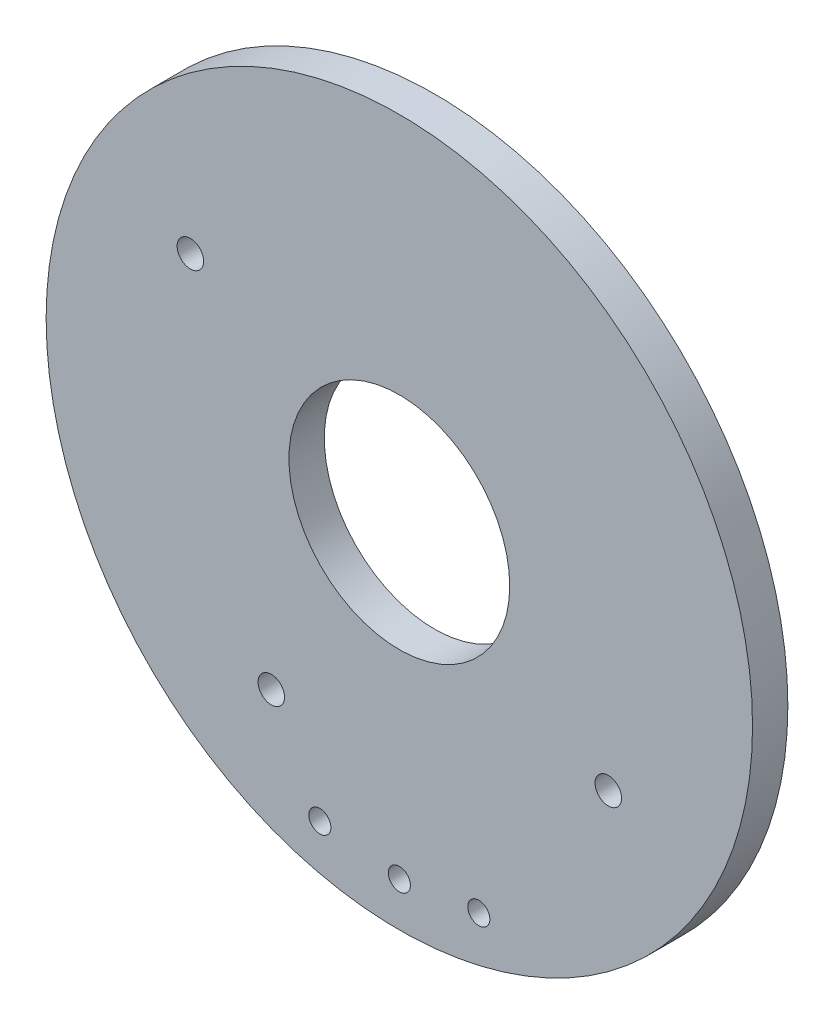
ISO-10303-21;
HEADER;
FILE_DESCRIPTION(('STEP AP214'),'2;1');
FILE_NAME('part.step','',(''),(''),'','','');
FILE_SCHEMA(('AUTOMOTIVE_DESIGN { 1 0 10303 214 1 1 1 1 }'));
ENDSEC;
DATA;
#1=APPLICATION_CONTEXT('core data for automotive mechanical design processes');
#2=APPLICATION_PROTOCOL_DEFINITION('international standard','automotive_design',2000,#1);
#3=PRODUCT_CONTEXT('',#1,'mechanical');
#4=PRODUCT('Part','Part','',(#3));
#5=PRODUCT_RELATED_PRODUCT_CATEGORY('part','',(#4));
#6=PRODUCT_DEFINITION_FORMATION('','',#4);
#7=PRODUCT_DEFINITION_CONTEXT('part definition',#1,'design');
#8=PRODUCT_DEFINITION('design','',#6,#7);
#9=PRODUCT_DEFINITION_SHAPE('','',#8);
#10=(LENGTH_UNIT() NAMED_UNIT(*) SI_UNIT(.MILLI.,.METRE.));
#11=(NAMED_UNIT(*) PLANE_ANGLE_UNIT() SI_UNIT($,.RADIAN.));
#12=(NAMED_UNIT(*) SI_UNIT($,.STERADIAN.) SOLID_ANGLE_UNIT());
#13=UNCERTAINTY_MEASURE_WITH_UNIT(LENGTH_MEASURE(1.E-05),#10,'distance_accuracy_value','');
#14=(GEOMETRIC_REPRESENTATION_CONTEXT(3) GLOBAL_UNCERTAINTY_ASSIGNED_CONTEXT((#13)) GLOBAL_UNIT_ASSIGNED_CONTEXT((#10,
#11,#12)) REPRESENTATION_CONTEXT('',''));
#15=CARTESIAN_POINT('',(0.,0.,0.));
#16=DIRECTION('',(0.,0.,1.));
#17=DIRECTION('',(1.,0.,0.));
#18=AXIS2_PLACEMENT_3D('',#15,#16,#17);
#19=CARTESIAN_POINT('',(0.,0.,0.8));
#20=DIRECTION('',(0.,0.,1.));
#21=DIRECTION('',(1.,0.,0.));
#22=AXIS2_PLACEMENT_3D('',#19,#20,#21);
#23=PLANE('',#22);
#24=CARTESIAN_POINT('',(-4.73299587998975,2.90000000000016,0.8));
#25=DIRECTION('',(0.,0.,1.));
#26=DIRECTION('',(1.,0.,0.));
#27=AXIS2_PLACEMENT_3D('',#24,#25,#26);
#28=CIRCLE('',#27,0.299999999999909);
#29=CARTESIAN_POINT('',(-4.43299587998985,2.90000000000016,0.8));
#30=VERTEX_POINT('',#29);
#31=EDGE_CURVE('E83',#30,#30,#28,.T.);
#32=ORIENTED_EDGE('',*,*,#31,.F.);
#33=EDGE_LOOP('',(#32));
#34=FACE_BOUND('',#33,.T.);
#35=CARTESIAN_POINT('',(-2.90000000000016,-4.73299587998975,0.8));
#36=DIRECTION('',(0.,0.,1.));
#37=DIRECTION('',(1.,0.,0.));
#38=AXIS2_PLACEMENT_3D('',#35,#36,#37);
#39=CIRCLE('',#38,0.300000000000102);
#40=CARTESIAN_POINT('',(-2.60000000000005,-4.73299587998975,0.8));
#41=VERTEX_POINT('',#40);
#42=EDGE_CURVE('E86',#41,#41,#39,.T.);
#43=ORIENTED_EDGE('',*,*,#42,.F.);
#44=EDGE_LOOP('',(#43));
#45=FACE_BOUND('',#44,.T.);
#46=CARTESIAN_POINT('',(4.73299587998975,-2.90000000000016,0.8));
#47=DIRECTION('',(0.,0.,1.));
#48=DIRECTION('',(1.,0.,0.));
#49=AXIS2_PLACEMENT_3D('',#46,#47,#48);
#50=CIRCLE('',#49,0.3);
#51=CARTESIAN_POINT('',(5.03299587998975,-2.90000000000016,0.8));
#52=VERTEX_POINT('',#51);
#53=EDGE_CURVE('E89',#52,#52,#50,.T.);
#54=ORIENTED_EDGE('',*,*,#53,.F.);
#55=EDGE_LOOP('',(#54));
#56=FACE_BOUND('',#55,.T.);
#57=CARTESIAN_POINT('',(1.8,-6.76461381011511,0.8));
#58=DIRECTION('',(0.,0.,1.));
#59=DIRECTION('',(1.,0.,0.));
#60=AXIS2_PLACEMENT_3D('',#57,#58,#59);
#61=CIRCLE('',#60,0.25);
#62=CARTESIAN_POINT('',(2.05,-6.76461381011511,0.8));
#63=VERTEX_POINT('',#62);
#64=EDGE_CURVE('E92',#63,#63,#61,.T.);
#65=ORIENTED_EDGE('',*,*,#64,.F.);
#66=EDGE_LOOP('',(#65));
#67=FACE_BOUND('',#66,.T.);
#68=CARTESIAN_POINT('',(-1.8,-6.76461381011511,0.8));
#69=DIRECTION('',(0.,0.,1.));
#70=DIRECTION('',(1.,0.,0.));
#71=AXIS2_PLACEMENT_3D('',#68,#69,#70);
#72=CIRCLE('',#71,0.25);
#73=CARTESIAN_POINT('',(-1.55,-6.76461381011511,0.8));
#74=VERTEX_POINT('',#73);
#75=EDGE_CURVE('E82',#74,#74,#72,.T.);
#76=ORIENTED_EDGE('',*,*,#75,.F.);
#77=EDGE_LOOP('',(#76));
#78=FACE_BOUND('',#77,.T.);
#79=CARTESIAN_POINT('',(0.,-7.,0.8));
#80=DIRECTION('',(0.,0.,1.));
#81=DIRECTION('',(1.,0.,0.));
#82=AXIS2_PLACEMENT_3D('',#79,#80,#81);
#83=CIRCLE('',#82,0.25);
#84=CARTESIAN_POINT('',(0.25,-7.,0.8));
#85=VERTEX_POINT('',#84);
#86=EDGE_CURVE('E58',#85,#85,#83,.T.);
#87=ORIENTED_EDGE('',*,*,#86,.F.);
#88=EDGE_LOOP('',(#87));
#89=FACE_BOUND('',#88,.T.);
#90=CARTESIAN_POINT('',(0.,0.,0.8));
#91=DIRECTION('',(0.,0.,1.));
#92=DIRECTION('',(1.,0.,0.));
#93=AXIS2_PLACEMENT_3D('',#90,#91,#92);
#94=CIRCLE('',#93,8.);
#95=CARTESIAN_POINT('',(8.,0.,0.8));
#96=VERTEX_POINT('',#95);
#97=EDGE_CURVE('E10',#96,#96,#94,.T.);
#98=ORIENTED_EDGE('',*,*,#97,.T.);
#99=EDGE_LOOP('',(#98));
#100=FACE_BOUND('',#99,.T.);
#101=CARTESIAN_POINT('',(0.,0.,0.8));
#102=DIRECTION('',(0.,0.,1.));
#103=DIRECTION('',(1.,0.,0.));
#104=AXIS2_PLACEMENT_3D('',#101,#102,#103);
#105=CIRCLE('',#104,2.5);
#106=CARTESIAN_POINT('',(2.5,0.,0.8));
#107=VERTEX_POINT('',#106);
#108=EDGE_CURVE('E48',#107,#107,#105,.T.);
#109=ORIENTED_EDGE('',*,*,#108,.F.);
#110=EDGE_LOOP('',(#109));
#111=FACE_BOUND('',#110,.T.);
#112=ADVANCED_FACE('F35',(#34,#45,#56,#67,#78,#89,#100,#111),#23,.T.);
#113=CARTESIAN_POINT('',(0.,0.,0.));
#114=DIRECTION('',(0.,0.,1.));
#115=DIRECTION('',(1.,0.,0.));
#116=AXIS2_PLACEMENT_3D('',#113,#114,#115);
#117=PLANE('',#116);
#118=CARTESIAN_POINT('',(-4.73299587998975,2.90000000000016,0.));
#119=DIRECTION('',(0.,0.,1.));
#120=DIRECTION('',(1.,0.,0.));
#121=AXIS2_PLACEMENT_3D('',#118,#119,#120);
#122=CIRCLE('',#121,0.299999999999909);
#123=CARTESIAN_POINT('',(-4.43299587998985,2.90000000000016,0.));
#124=VERTEX_POINT('',#123);
#125=EDGE_CURVE('E39',#124,#124,#122,.T.);
#126=ORIENTED_EDGE('',*,*,#125,.T.);
#127=EDGE_LOOP('',(#126));
#128=FACE_BOUND('',#127,.T.);
#129=CARTESIAN_POINT('',(-2.90000000000016,-4.73299587998975,0.));
#130=DIRECTION('',(0.,0.,1.));
#131=DIRECTION('',(1.,0.,0.));
#132=AXIS2_PLACEMENT_3D('',#129,#130,#131);
#133=CIRCLE('',#132,0.300000000000102);
#134=CARTESIAN_POINT('',(-2.60000000000005,-4.73299587998975,0.));
#135=VERTEX_POINT('',#134);
#136=EDGE_CURVE('E66',#135,#135,#133,.T.);
#137=ORIENTED_EDGE('',*,*,#136,.T.);
#138=EDGE_LOOP('',(#137));
#139=FACE_BOUND('',#138,.T.);
#140=CARTESIAN_POINT('',(4.73299587998975,-2.90000000000016,0.));
#141=DIRECTION('',(0.,0.,1.));
#142=DIRECTION('',(1.,0.,0.));
#143=AXIS2_PLACEMENT_3D('',#140,#141,#142);
#144=CIRCLE('',#143,0.3);
#145=CARTESIAN_POINT('',(5.03299587998975,-2.90000000000016,0.));
#146=VERTEX_POINT('',#145);
#147=EDGE_CURVE('E64',#146,#146,#144,.T.);
#148=ORIENTED_EDGE('',*,*,#147,.T.);
#149=EDGE_LOOP('',(#148));
#150=FACE_BOUND('',#149,.T.);
#151=CARTESIAN_POINT('',(1.8,-6.76461381011511,0.));
#152=DIRECTION('',(0.,0.,1.));
#153=DIRECTION('',(1.,0.,0.));
#154=AXIS2_PLACEMENT_3D('',#151,#152,#153);
#155=CIRCLE('',#154,0.25);
#156=CARTESIAN_POINT('',(2.05,-6.76461381011511,0.));
#157=VERTEX_POINT('',#156);
#158=EDGE_CURVE('E61',#157,#157,#155,.T.);
#159=ORIENTED_EDGE('',*,*,#158,.T.);
#160=EDGE_LOOP('',(#159));
#161=FACE_BOUND('',#160,.T.);
#162=CARTESIAN_POINT('',(-1.8,-6.76461381011511,0.));
#163=DIRECTION('',(0.,0.,1.));
#164=DIRECTION('',(1.,0.,0.));
#165=AXIS2_PLACEMENT_3D('',#162,#163,#164);
#166=CIRCLE('',#165,0.25);
#167=CARTESIAN_POINT('',(-1.55,-6.76461381011511,0.));
#168=VERTEX_POINT('',#167);
#169=EDGE_CURVE('E57',#168,#168,#166,.T.);
#170=ORIENTED_EDGE('',*,*,#169,.T.);
#171=EDGE_LOOP('',(#170));
#172=FACE_BOUND('',#171,.T.);
#173=CARTESIAN_POINT('',(0.,-7.,0.));
#174=DIRECTION('',(0.,0.,1.));
#175=DIRECTION('',(1.,0.,0.));
#176=AXIS2_PLACEMENT_3D('',#173,#174,#175);
#177=CIRCLE('',#176,0.25);
#178=CARTESIAN_POINT('',(0.25,-7.,0.));
#179=VERTEX_POINT('',#178);
#180=EDGE_CURVE('E54',#179,#179,#177,.T.);
#181=ORIENTED_EDGE('',*,*,#180,.T.);
#182=EDGE_LOOP('',(#181));
#183=FACE_BOUND('',#182,.T.);
#184=CARTESIAN_POINT('',(0.,0.,0.));
#185=DIRECTION('',(0.,0.,1.));
#186=DIRECTION('',(1.,0.,0.));
#187=AXIS2_PLACEMENT_3D('',#184,#185,#186);
#188=CIRCLE('',#187,8.);
#189=CARTESIAN_POINT('',(8.,0.,0.));
#190=VERTEX_POINT('',#189);
#191=EDGE_CURVE('E43',#190,#190,#188,.T.);
#192=ORIENTED_EDGE('',*,*,#191,.F.);
#193=EDGE_LOOP('',(#192));
#194=FACE_BOUND('',#193,.T.);
#195=CARTESIAN_POINT('',(0.,0.,0.));
#196=DIRECTION('',(0.,0.,1.));
#197=DIRECTION('',(1.,0.,0.));
#198=AXIS2_PLACEMENT_3D('',#195,#196,#197);
#199=CIRCLE('',#198,2.5);
#200=CARTESIAN_POINT('',(2.5,0.,0.));
#201=VERTEX_POINT('',#200);
#202=EDGE_CURVE('E51',#201,#201,#199,.T.);
#203=ORIENTED_EDGE('',*,*,#202,.T.);
#204=EDGE_LOOP('',(#203));
#205=FACE_BOUND('',#204,.T.);
#206=ADVANCED_FACE('F103',(#128,#139,#150,#161,#172,#183,#194,#205),#117,.F.);
#207=CARTESIAN_POINT('',(0.,0.,0.8));
#208=DIRECTION('',(0.,0.,-1.));
#209=DIRECTION('',(-1.,0.,0.));
#210=AXIS2_PLACEMENT_3D('',#207,#208,#209);
#211=CYLINDRICAL_SURFACE('',#210,8.);
#212=ORIENTED_EDGE('',*,*,#97,.F.);
#213=EDGE_LOOP('',(#212));
#214=FACE_BOUND('',#213,.T.);
#215=ORIENTED_EDGE('',*,*,#191,.T.);
#216=EDGE_LOOP('',(#215));
#217=FACE_BOUND('',#216,.T.);
#218=ADVANCED_FACE('F37',(#214,#217),#211,.T.);
#219=CARTESIAN_POINT('',(0.,0.,0.8));
#220=DIRECTION('',(0.,0.,-1.));
#221=DIRECTION('',(-1.,0.,0.));
#222=AXIS2_PLACEMENT_3D('',#219,#220,#221);
#223=CYLINDRICAL_SURFACE('',#222,2.5);
#224=ORIENTED_EDGE('',*,*,#108,.T.);
#225=EDGE_LOOP('',(#224));
#226=FACE_BOUND('',#225,.T.);
#227=ORIENTED_EDGE('',*,*,#202,.F.);
#228=EDGE_LOOP('',(#227));
#229=FACE_BOUND('',#228,.T.);
#230=ADVANCED_FACE('F112',(#226,#229),#223,.F.);
#231=CARTESIAN_POINT('',(0.,-7.,-0.8));
#232=DIRECTION('',(0.,0.,1.));
#233=DIRECTION('',(1.,0.,0.));
#234=AXIS2_PLACEMENT_3D('',#231,#232,#233);
#235=CYLINDRICAL_SURFACE('',#234,0.25);
#236=ORIENTED_EDGE('',*,*,#86,.T.);
#237=EDGE_LOOP('',(#236));
#238=FACE_BOUND('',#237,.T.);
#239=ORIENTED_EDGE('',*,*,#180,.F.);
#240=EDGE_LOOP('',(#239));
#241=FACE_BOUND('',#240,.T.);
#242=ADVANCED_FACE('F109',(#238,#241),#235,.F.);
#243=CARTESIAN_POINT('',(-1.8,-6.76461381011511,-0.8));
#244=DIRECTION('',(0.,0.,1.));
#245=DIRECTION('',(1.,0.,0.));
#246=AXIS2_PLACEMENT_3D('',#243,#244,#245);
#247=CYLINDRICAL_SURFACE('',#246,0.25);
#248=ORIENTED_EDGE('',*,*,#75,.T.);
#249=EDGE_LOOP('',(#248));
#250=FACE_BOUND('',#249,.T.);
#251=ORIENTED_EDGE('',*,*,#169,.F.);
#252=EDGE_LOOP('',(#251));
#253=FACE_BOUND('',#252,.T.);
#254=ADVANCED_FACE('F98',(#250,#253),#247,.F.);
#255=CARTESIAN_POINT('',(1.8,-6.76461381011511,-0.8));
#256=DIRECTION('',(0.,0.,1.));
#257=DIRECTION('',(1.,0.,0.));
#258=AXIS2_PLACEMENT_3D('',#255,#256,#257);
#259=CYLINDRICAL_SURFACE('',#258,0.25);
#260=ORIENTED_EDGE('',*,*,#64,.T.);
#261=EDGE_LOOP('',(#260));
#262=FACE_BOUND('',#261,.T.);
#263=ORIENTED_EDGE('',*,*,#158,.F.);
#264=EDGE_LOOP('',(#263));
#265=FACE_BOUND('',#264,.T.);
#266=ADVANCED_FACE('F141',(#262,#265),#259,.F.);
#267=CARTESIAN_POINT('',(4.73299587998975,-2.90000000000016,-0.8));
#268=DIRECTION('',(0.,0.,1.));
#269=DIRECTION('',(1.,0.,0.));
#270=AXIS2_PLACEMENT_3D('',#267,#268,#269);
#271=CYLINDRICAL_SURFACE('',#270,0.3);
#272=ORIENTED_EDGE('',*,*,#53,.T.);
#273=EDGE_LOOP('',(#272));
#274=FACE_BOUND('',#273,.T.);
#275=ORIENTED_EDGE('',*,*,#147,.F.);
#276=EDGE_LOOP('',(#275));
#277=FACE_BOUND('',#276,.T.);
#278=ADVANCED_FACE('F137',(#274,#277),#271,.F.);
#279=CARTESIAN_POINT('',(-2.90000000000016,-4.73299587998975,-0.8));
#280=DIRECTION('',(0.,0.,1.));
#281=DIRECTION('',(1.,0.,0.));
#282=AXIS2_PLACEMENT_3D('',#279,#280,#281);
#283=CYLINDRICAL_SURFACE('',#282,0.300000000000102);
#284=ORIENTED_EDGE('',*,*,#42,.T.);
#285=EDGE_LOOP('',(#284));
#286=FACE_BOUND('',#285,.T.);
#287=ORIENTED_EDGE('',*,*,#136,.F.);
#288=EDGE_LOOP('',(#287));
#289=FACE_BOUND('',#288,.T.);
#290=ADVANCED_FACE('F133',(#286,#289),#283,.F.);
#291=CARTESIAN_POINT('',(-4.73299587998975,2.90000000000016,-0.8));
#292=DIRECTION('',(0.,0.,1.));
#293=DIRECTION('',(1.,0.,0.));
#294=AXIS2_PLACEMENT_3D('',#291,#292,#293);
#295=CYLINDRICAL_SURFACE('',#294,0.299999999999909);
#296=ORIENTED_EDGE('',*,*,#31,.T.);
#297=EDGE_LOOP('',(#296));
#298=FACE_BOUND('',#297,.T.);
#299=ORIENTED_EDGE('',*,*,#125,.F.);
#300=EDGE_LOOP('',(#299));
#301=FACE_BOUND('',#300,.T.);
#302=ADVANCED_FACE('F130',(#298,#301),#295,.F.);
#303=CLOSED_SHELL('',(#112,#206,#218,#230,#242,#254,#266,#278,#290,#302));
#304=MANIFOLD_SOLID_BREP('B2',#303);
#305=ADVANCED_BREP_SHAPE_REPRESENTATION('',(#18,#304),#14);
#306=SHAPE_DEFINITION_REPRESENTATION(#9,#305);
ENDSEC;
END-ISO-10303-21;
